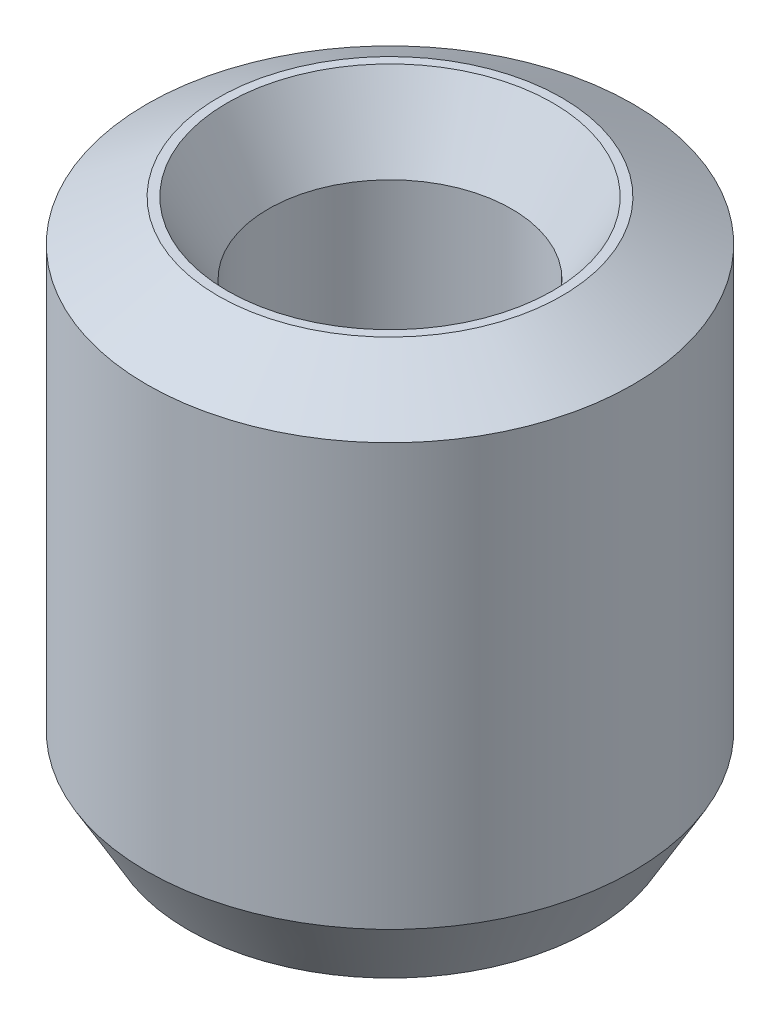
ISO-10303-21;
HEADER;
FILE_DESCRIPTION(('STEP AP214'),'2;1');
FILE_NAME('part.step','',(''),(''),'','','');
FILE_SCHEMA(('AUTOMOTIVE_DESIGN { 1 0 10303 214 1 1 1 1 }'));
ENDSEC;
DATA;
#1=APPLICATION_CONTEXT('core data for automotive mechanical design processes');
#2=APPLICATION_PROTOCOL_DEFINITION('international standard','automotive_design',2000,#1);
#3=PRODUCT_CONTEXT('',#1,'mechanical');
#4=PRODUCT('Part','Part','',(#3));
#5=PRODUCT_RELATED_PRODUCT_CATEGORY('part','',(#4));
#6=PRODUCT_DEFINITION_FORMATION('','',#4);
#7=PRODUCT_DEFINITION_CONTEXT('part definition',#1,'design');
#8=PRODUCT_DEFINITION('design','',#6,#7);
#9=PRODUCT_DEFINITION_SHAPE('','',#8);
#10=(LENGTH_UNIT() NAMED_UNIT(*) SI_UNIT(.MILLI.,.METRE.));
#11=(NAMED_UNIT(*) PLANE_ANGLE_UNIT() SI_UNIT($,.RADIAN.));
#12=(NAMED_UNIT(*) SI_UNIT($,.STERADIAN.) SOLID_ANGLE_UNIT());
#13=UNCERTAINTY_MEASURE_WITH_UNIT(LENGTH_MEASURE(1.E-05),#10,'distance_accuracy_value','');
#14=(GEOMETRIC_REPRESENTATION_CONTEXT(3) GLOBAL_UNCERTAINTY_ASSIGNED_CONTEXT((#13)) GLOBAL_UNIT_ASSIGNED_CONTEXT((#10,
#11,#12)) REPRESENTATION_CONTEXT('',''));
#15=CARTESIAN_POINT('',(0.,0.,0.));
#16=DIRECTION('',(0.,0.,1.));
#17=DIRECTION('',(1.,0.,0.));
#18=AXIS2_PLACEMENT_3D('',#15,#16,#17);
#19=CARTESIAN_POINT('',(0.,49.4186081053052,0.));
#20=DIRECTION('',(0.,-1.,0.));
#21=DIRECTION('',(0.,0.,-1.));
#22=AXIS2_PLACEMENT_3D('',#19,#20,#21);
#23=CYLINDRICAL_SURFACE('',#22,22.5);
#24=CARTESIAN_POINT('',(0.,6.59709905746745,0.));
#25=DIRECTION('',(0.,1.,0.));
#26=DIRECTION('',(0.,0.,1.));
#27=AXIS2_PLACEMENT_3D('',#24,#25,#26);
#28=CIRCLE('',#27,22.5);
#29=CARTESIAN_POINT('',(0.,6.59709905746745,22.5));
#30=VERTEX_POINT('',#29);
#31=EDGE_CURVE('E10',#30,#30,#28,.T.);
#32=ORIENTED_EDGE('',*,*,#31,.T.);
#33=EDGE_LOOP('',(#32));
#34=FACE_BOUND('',#33,.T.);
#35=CARTESIAN_POINT('',(0.,45.6097711886058,0.));
#36=DIRECTION('',(0.,1.,0.));
#37=DIRECTION('',(0.,0.,1.));
#38=AXIS2_PLACEMENT_3D('',#35,#36,#37);
#39=CIRCLE('',#38,22.5);
#40=CARTESIAN_POINT('',(0.,45.6097711886058,-22.5));
#41=VERTEX_POINT('',#40);
#42=EDGE_CURVE('E50',#41,#41,#39,.F.);
#43=ORIENTED_EDGE('',*,*,#42,.T.);
#44=EDGE_LOOP('',(#43));
#45=FACE_BOUND('',#44,.T.);
#46=ADVANCED_FACE('F39',(#34,#45),#23,.T.);
#47=CARTESIAN_POINT('',(0.,49.4186081053052,0.));
#48=DIRECTION('',(0.,1.,0.));
#49=DIRECTION('',(0.,0.,1.));
#50=AXIS2_PLACEMENT_3D('',#47,#48,#49);
#51=PLANE('',#50);
#52=CARTESIAN_POINT('',(0.,49.4186081053052,0.));
#53=DIRECTION('',(0.,1.,0.));
#54=DIRECTION('',(0.,0.,1.));
#55=AXIS2_PLACEMENT_3D('',#52,#53,#54);
#56=CIRCLE('',#55,15.0686838741817);
#57=CARTESIAN_POINT('',(0.,49.4186081053052,15.0686838741817));
#58=VERTEX_POINT('',#57);
#59=EDGE_CURVE('E58',#58,#58,#56,.F.);
#60=ORIENTED_EDGE('',*,*,#59,.T.);
#61=EDGE_LOOP('',(#60));
#62=FACE_BOUND('',#61,.T.);
#63=CARTESIAN_POINT('',(0.,49.4186081053052,0.));
#64=DIRECTION('',(0.,1.,0.));
#65=DIRECTION('',(0.,0.,1.));
#66=AXIS2_PLACEMENT_3D('',#63,#64,#65);
#67=CIRCLE('',#66,15.9029009425326);
#68=CARTESIAN_POINT('',(0.,49.4186081053052,-15.9029009425326));
#69=VERTEX_POINT('',#68);
#70=EDGE_CURVE('E61',#69,#69,#67,.T.);
#71=ORIENTED_EDGE('',*,*,#70,.T.);
#72=EDGE_LOOP('',(#71));
#73=FACE_BOUND('',#72,.T.);
#74=ADVANCED_FACE('F88',(#62,#73),#51,.T.);
#75=CARTESIAN_POINT('',(0.,0.,0.));
#76=DIRECTION('',(0.,1.,0.));
#77=DIRECTION('',(0.,0.,1.));
#78=AXIS2_PLACEMENT_3D('',#75,#76,#77);
#79=PLANE('',#78);
#80=CARTESIAN_POINT('',(0.,0.,0.));
#81=DIRECTION('',(0.,1.,0.));
#82=DIRECTION('',(0.,0.,1.));
#83=AXIS2_PLACEMENT_3D('',#80,#81,#82);
#84=CIRCLE('',#83,17.8569460149497);
#85=CARTESIAN_POINT('',(0.,0.,17.8569460149497));
#86=VERTEX_POINT('',#85);
#87=EDGE_CURVE('E51',#86,#86,#84,.T.);
#88=ORIENTED_EDGE('',*,*,#87,.T.);
#89=EDGE_LOOP('',(#88));
#90=FACE_BOUND('',#89,.T.);
#91=CARTESIAN_POINT('',(0.,0.,0.));
#92=DIRECTION('',(0.,1.,0.));
#93=DIRECTION('',(0.,0.,1.));
#94=AXIS2_PLACEMENT_3D('',#91,#92,#93);
#95=CIRCLE('',#94,18.6911630833005);
#96=CARTESIAN_POINT('',(0.,0.,18.6911630833005));
#97=VERTEX_POINT('',#96);
#98=EDGE_CURVE('E54',#97,#97,#95,.F.);
#99=ORIENTED_EDGE('',*,*,#98,.T.);
#100=EDGE_LOOP('',(#99));
#101=FACE_BOUND('',#100,.T.);
#102=ADVANCED_FACE('F83',(#90,#101),#79,.F.);
#103=CARTESIAN_POINT('',(0.,49.4186081053052,0.));
#104=DIRECTION('',(0.,-1.,0.));
#105=DIRECTION('',(0.,0.,-1.));
#106=AXIS2_PLACEMENT_3D('',#103,#104,#105);
#107=CYLINDRICAL_SURFACE('',#106,11.2598469574823);
#108=CARTESIAN_POINT('',(0.,42.8215090478378,0.));
#109=DIRECTION('',(0.,1.,0.));
#110=DIRECTION('',(0.,0.,1.));
#111=AXIS2_PLACEMENT_3D('',#108,#109,#110);
#112=CIRCLE('',#111,11.2598469574823);
#113=CARTESIAN_POINT('',(0.,42.8215090478378,11.2598469574823));
#114=VERTEX_POINT('',#113);
#115=EDGE_CURVE('E67',#114,#114,#112,.T.);
#116=ORIENTED_EDGE('',*,*,#115,.T.);
#117=EDGE_LOOP('',(#116));
#118=FACE_BOUND('',#117,.T.);
#119=CARTESIAN_POINT('',(0.,3.80883691669949,0.));
#120=DIRECTION('',(0.,1.,0.));
#121=DIRECTION('',(0.,0.,1.));
#122=AXIS2_PLACEMENT_3D('',#119,#120,#121);
#123=CIRCLE('',#122,11.2598469574823);
#124=CARTESIAN_POINT('',(0.,3.80883691669949,11.2598469574823));
#125=VERTEX_POINT('',#124);
#126=EDGE_CURVE('E69',#125,#125,#123,.F.);
#127=ORIENTED_EDGE('',*,*,#126,.T.);
#128=EDGE_LOOP('',(#127));
#129=FACE_BOUND('',#128,.T.);
#130=ADVANCED_FACE('F71',(#118,#129),#107,.F.);
#131=CARTESIAN_POINT('',(0.,42.8215090478378,0.));
#132=DIRECTION('',(0.,1.,0.));
#133=DIRECTION('',(0.,0.,1.));
#134=AXIS2_PLACEMENT_3D('',#131,#132,#133);
#135=CONICAL_SURFACE('',#134,11.2598469574823,0.523598775598302);
#136=CARTESIAN_POINT('',(0.,49.4186081053052,15.0686838741817));
#137=CARTESIAN_POINT('',(0.,49.3498883234566,15.0290084896328));
#138=CARTESIAN_POINT('',(0.,49.281168541608,14.9893331050838));
#139=CARTESIAN_POINT('',(0.,49.1437289779108,14.9099823359859));
#140=CARTESIAN_POINT('',(0.,49.0750091960621,14.870306951437));
#141=CARTESIAN_POINT('',(0.,48.9375696323649,14.7909561823391));
#142=CARTESIAN_POINT('',(0.,48.8688498505163,14.7512807977901));
#143=CARTESIAN_POINT('',(0.,48.731410286819,14.6719300286922));
#144=CARTESIAN_POINT('',(0.,48.6626905049704,14.6322546441432));
#145=CARTESIAN_POINT('',(0.,48.5252509412732,14.5529038750453));
#146=CARTESIAN_POINT('',(0.,48.4565311594246,14.5132284904964));
#147=CARTESIAN_POINT('',(0.,48.3190915957273,14.4338777213985));
#148=CARTESIAN_POINT('',(0.,48.2503718138787,14.3942023368495));
#149=CARTESIAN_POINT('',(0.,48.1129322501815,14.3148515677516));
#150=CARTESIAN_POINT('',(0.,48.0442124683329,14.2751761832027));
#151=CARTESIAN_POINT('',(0.,47.9067729046356,14.1958254141048));
#152=CARTESIAN_POINT('',(0.,47.838053122787,14.1561500295558));
#153=CARTESIAN_POINT('',(0.,47.7006135590898,14.0767992604579));
#154=CARTESIAN_POINT('',(0.,47.6318937772411,14.037123875909));
#155=CARTESIAN_POINT('',(0.,47.4944542135439,13.957773106811));
#156=CARTESIAN_POINT('',(0.,47.4257344316953,13.9180977222621));
#157=CARTESIAN_POINT('',(0.,47.288294867998,13.8387469531642));
#158=CARTESIAN_POINT('',(0.,47.2195750861494,13.7990715686152));
#159=CARTESIAN_POINT('',(0.,47.0821355224522,13.7197207995173));
#160=CARTESIAN_POINT('',(0.,47.0134157406036,13.6800454149684));
#161=CARTESIAN_POINT('',(0.,46.8759761769063,13.6006946458705));
#162=CARTESIAN_POINT('',(0.,46.8072563950577,13.5610192613215));
#163=CARTESIAN_POINT('',(0.,46.6698168313605,13.4816684922236));
#164=CARTESIAN_POINT('',(0.,46.6010970495119,13.4419931076747));
#165=CARTESIAN_POINT('',(0.,46.4636574858146,13.3626423385768));
#166=CARTESIAN_POINT('',(0.,46.394937703966,13.3229669540278));
#167=CARTESIAN_POINT('',(0.,46.2574981402688,13.2436161849299));
#168=CARTESIAN_POINT('',(0.,46.1887783584201,13.2039408003809));
#169=CARTESIAN_POINT('',(0.,46.0513387947229,13.124590031283));
#170=CARTESIAN_POINT('',(0.,45.9826190128743,13.0849146467341));
#171=CARTESIAN_POINT('',(0.,45.845179449177,13.0055638776362));
#172=CARTESIAN_POINT('',(0.,45.7764596673284,12.9658884930872));
#173=CARTESIAN_POINT('',(0.,45.6390201036312,12.8865377239893));
#174=CARTESIAN_POINT('',(0.,45.5703003217826,12.8468623394404));
#175=CARTESIAN_POINT('',(0.,45.4328607580853,12.7675115703425));
#176=CARTESIAN_POINT('',(0.,45.3641409762367,12.7278361857935));
#177=CARTESIAN_POINT('',(0.,45.2267014125395,12.6484854166956));
#178=CARTESIAN_POINT('',(0.,45.1579816306909,12.6088100321466));
#179=CARTESIAN_POINT('',(0.,45.0205420669936,12.5294592630487));
#180=CARTESIAN_POINT('',(0.,44.951822285145,12.4897838784998));
#181=CARTESIAN_POINT('',(0.,44.8143827214478,12.4104331094019));
#182=CARTESIAN_POINT('',(0.,44.7456629395991,12.3707577248529));
#183=CARTESIAN_POINT('',(0.,44.6082233759019,12.291406955755));
#184=CARTESIAN_POINT('',(0.,44.5395035940533,12.2517315712061));
#185=CARTESIAN_POINT('',(0.,44.402064030356,12.1723808021082));
#186=CARTESIAN_POINT('',(0.,44.3333442485074,12.1327054175592));
#187=CARTESIAN_POINT('',(0.,44.1959046848102,12.0533546484613));
#188=CARTESIAN_POINT('',(0.,44.1271849029616,12.0136792639124));
#189=CARTESIAN_POINT('',(0.,43.9897453392643,11.9343284948145));
#190=CARTESIAN_POINT('',(0.,43.9210255574157,11.8946531102655));
#191=CARTESIAN_POINT('',(0.,43.7835859937185,11.8153023411676));
#192=CARTESIAN_POINT('',(0.,43.7148662118698,11.7756269566186));
#193=CARTESIAN_POINT('',(0.,43.5774266481726,11.6962761875207));
#194=CARTESIAN_POINT('',(0.,43.508706866324,11.6566008029718));
#195=CARTESIAN_POINT('',(0.,43.3712673026268,11.5772500338739));
#196=CARTESIAN_POINT('',(0.,43.3025475207781,11.5375746493249));
#197=CARTESIAN_POINT('',(0.,43.1651079570809,11.458223880227));
#198=CARTESIAN_POINT('',(0.,43.0963881752323,11.4185484956781));
#199=CARTESIAN_POINT('',(0.,42.958948611535,11.3391977265802));
#200=CARTESIAN_POINT('',(0.,42.8902288296864,11.2995223420312));
#201=CARTESIAN_POINT('',(0.,42.8215090478378,11.2598469574823));
#202=B_SPLINE_CURVE_WITH_KNOTS('',3,(#136,#137,#138,#139,#140,#141,#142,#143,#144,#145,#146,
#147,#148,#149,#150,#151,#152,#153,#154,#155,#156,#157,#158,#159,#160,#161,#162,#163,#164,#165,
#166,#167,#168,#169,#170,#171,#172,#173,#174,#175,#176,#177,#178,#179,#180,#181,#182,#183,#184,
#185,#186,#187,#188,#189,#190,#191,#192,#193,#194,#195,#196,#197,#198,#199,#200,#201),
.UNSPECIFIED.,.F.,.F.,(4,2,2,2,2,2,2,2,2,2,2,2,2,2,2,2,2,2,2,2,2,2,2,2,2,2,2,2,2,2,2,2,4),(0.,
0.238052307293712,0.476104614587432,0.714156921881143,0.952209229174863,1.19026153646858,
1.42831384376229,1.66636615105601,1.90441845834972,2.14247076564344,2.38052307293716,
2.61857538023087,2.85662768752459,3.09467999481831,3.33273230211202,3.57078460940574,
3.80883691669945,4.04688922399317,4.28494153128689,4.5229938385806,4.76104614587432,
4.99909845316804,5.23715076046175,5.47520306775547,5.71325537504919,5.9513076823429,
6.18935998963662,6.42741229693033,6.66546460422405,6.90351691151777,7.14156921881148,
7.3796215261052,7.61767383339891),.UNSPECIFIED.);
#203=EDGE_CURVE('BSEAM77',#58,#114,#202,.T.);
#204=ORIENTED_EDGE('',*,*,#59,.F.);
#205=ORIENTED_EDGE('',*,*,#115,.F.);
#206=ORIENTED_EDGE('',*,*,#203,.T.);
#207=ORIENTED_EDGE('',*,*,#203,.F.);
#208=EDGE_LOOP('',(#204,#206,#205,#207));
#209=FACE_BOUND('',#208,.T.);
#210=ADVANCED_FACE('F77',(#209),#135,.F.);
#211=CARTESIAN_POINT('',(0.,0.,0.));
#212=DIRECTION('',(0.,-1.,0.));
#213=DIRECTION('',(0.,0.,-1.));
#214=AXIS2_PLACEMENT_3D('',#211,#212,#213);
#215=CONICAL_SURFACE('',#214,17.8569460149497,1.04719755119659);
#216=ORIENTED_EDGE('',*,*,#126,.F.);
#217=EDGE_LOOP('',(#216));
#218=FACE_BOUND('',#217,.T.);
#219=ORIENTED_EDGE('',*,*,#87,.F.);
#220=EDGE_LOOP('',(#219));
#221=FACE_BOUND('',#220,.T.);
#222=ADVANCED_FACE('F73',(#218,#221),#215,.F.);
#223=CARTESIAN_POINT('',(0.,6.59709905746745,0.));
#224=DIRECTION('',(0.,1.,0.));
#225=DIRECTION('',(0.,0.,1.));
#226=AXIS2_PLACEMENT_3D('',#223,#224,#225);
#227=CONICAL_SURFACE('',#226,22.5,0.523598775598303);
#228=ORIENTED_EDGE('',*,*,#98,.F.);
#229=EDGE_LOOP('',(#228));
#230=FACE_BOUND('',#229,.T.);
#231=ORIENTED_EDGE('',*,*,#31,.F.);
#232=EDGE_LOOP('',(#231));
#233=FACE_BOUND('',#232,.T.);
#234=ADVANCED_FACE('F76',(#230,#233),#227,.T.);
#235=CARTESIAN_POINT('',(0.,49.4186081053052,0.));
#236=DIRECTION('',(0.,-1.,0.));
#237=DIRECTION('',(0.,0.,-1.));
#238=AXIS2_PLACEMENT_3D('',#235,#236,#237);
#239=CONICAL_SURFACE('',#238,15.9029009425326,1.04719755119659);
#240=CARTESIAN_POINT('',(0.,45.6097711886058,-22.5));
#241=CARTESIAN_POINT('',(0.,45.6494465731547,-22.4312802181514));
#242=CARTESIAN_POINT('',(0.,45.6891219577037,-22.3625604363028));
#243=CARTESIAN_POINT('',(0.,45.7684727268016,-22.2251208726055));
#244=CARTESIAN_POINT('',(0.,45.8081481113505,-22.1564010907569));
#245=CARTESIAN_POINT('',(0.,45.8874988804484,-22.0189615270597));
#246=CARTESIAN_POINT('',(0.,45.9271742649974,-21.9502417452111));
#247=CARTESIAN_POINT('',(0.,46.0065250340953,-21.8128021815138));
#248=CARTESIAN_POINT('',(0.,46.0462004186442,-21.7440823996652));
#249=CARTESIAN_POINT('',(0.,46.1255511877421,-21.606642835968));
#250=CARTESIAN_POINT('',(0.,46.1652265722911,-21.5379230541193));
#251=CARTESIAN_POINT('',(0.,46.244577341389,-21.4004834904221));
#252=CARTESIAN_POINT('',(0.,46.284252725938,-21.3317637085735));
#253=CARTESIAN_POINT('',(0.,46.3636034950359,-21.1943241448762));
#254=CARTESIAN_POINT('',(0.,46.4032788795848,-21.1256043630276));
#255=CARTESIAN_POINT('',(0.,46.4826296486827,-20.9881647993304));
#256=CARTESIAN_POINT('',(0.,46.5223050332317,-20.9194450174818));
#257=CARTESIAN_POINT('',(0.,46.6016558023296,-20.7820054537845));
#258=CARTESIAN_POINT('',(0.,46.6413311868785,-20.7132856719359));
#259=CARTESIAN_POINT('',(0.,46.7206819559764,-20.5758461082387));
#260=CARTESIAN_POINT('',(0.,46.7603573405254,-20.5071263263901));
#261=CARTESIAN_POINT('',(0.,46.8397081096233,-20.3696867626928));
#262=CARTESIAN_POINT('',(0.,46.8793834941722,-20.3009669808442));
#263=CARTESIAN_POINT('',(0.,46.9587342632702,-20.163527417147));
#264=CARTESIAN_POINT('',(0.,46.9984096478191,-20.0948076352983));
#265=CARTESIAN_POINT('',(0.,47.077760416917,-19.9573680716011));
#266=CARTESIAN_POINT('',(0.,47.117435801466,-19.8886482897525));
#267=CARTESIAN_POINT('',(0.,47.1967865705639,-19.7512087260552));
#268=CARTESIAN_POINT('',(0.,47.2364619551128,-19.6824889442066));
#269=CARTESIAN_POINT('',(0.,47.3158127242107,-19.5450493805094));
#270=CARTESIAN_POINT('',(0.,47.3554881087597,-19.4763295986608));
#271=CARTESIAN_POINT('',(0.,47.4348388778576,-19.3388900349635));
#272=CARTESIAN_POINT('',(0.,47.4745142624065,-19.2701702531149));
#273=CARTESIAN_POINT('',(0.,47.5538650315044,-19.1327306894177));
#274=CARTESIAN_POINT('',(0.,47.5935404160534,-19.064010907569));
#275=CARTESIAN_POINT('',(0.,47.6728911851513,-18.9265713438718));
#276=CARTESIAN_POINT('',(0.,47.7125665697003,-18.8578515620232));
#277=CARTESIAN_POINT('',(0.,47.7919173387982,-18.720411998326));
#278=CARTESIAN_POINT('',(0.,47.8315927233471,-18.6516922164773));
#279=CARTESIAN_POINT('',(0.,47.910943492445,-18.5142526527801));
#280=CARTESIAN_POINT('',(0.,47.950618876994,-18.4455328709315));
#281=CARTESIAN_POINT('',(0.,48.0299696460919,-18.3080933072342));
#282=CARTESIAN_POINT('',(0.,48.0696450306408,-18.2393735253856));
#283=CARTESIAN_POINT('',(0.,48.1489957997387,-18.1019339616884));
#284=CARTESIAN_POINT('',(0.,48.1886711842877,-18.0332141798398));
#285=CARTESIAN_POINT('',(0.,48.2680219533856,-17.8957746161425));
#286=CARTESIAN_POINT('',(0.,48.3076973379346,-17.8270548342939));
#287=CARTESIAN_POINT('',(0.,48.3870481070325,-17.6896152705967));
#288=CARTESIAN_POINT('',(0.,48.4267234915814,-17.620895488748));
#289=CARTESIAN_POINT('',(0.,48.5060742606793,-17.4834559250508));
#290=CARTESIAN_POINT('',(0.,48.5457496452283,-17.4147361432022));
#291=CARTESIAN_POINT('',(0.,48.6251004143262,-17.277296579505));
#292=CARTESIAN_POINT('',(0.,48.6647757988751,-17.2085767976563));
#293=CARTESIAN_POINT('',(0.,48.744126567973,-17.0711372339591));
#294=CARTESIAN_POINT('',(0.,48.783801952522,-17.0024174521105));
#295=CARTESIAN_POINT('',(0.,48.8631527216199,-16.8649778884132));
#296=CARTESIAN_POINT('',(0.,48.9028281061688,-16.7962581065646));
#297=CARTESIAN_POINT('',(0.,48.9821788752667,-16.6588185428674));
#298=CARTESIAN_POINT('',(0.,49.0218542598157,-16.5900987610188));
#299=CARTESIAN_POINT('',(0.,49.1012050289136,-16.4526591973215));
#300=CARTESIAN_POINT('',(0.,49.1408804134626,-16.3839394154729));
#301=CARTESIAN_POINT('',(0.,49.2202311825605,-16.2464998517757));
#302=CARTESIAN_POINT('',(0.,49.2599065671094,-16.177780069927));
#303=CARTESIAN_POINT('',(0.,49.3392573362073,-16.0403405062298));
#304=CARTESIAN_POINT('',(0.,49.3789327207563,-15.9716207243812));
#305=CARTESIAN_POINT('',(0.,49.4186081053052,-15.9029009425326));
#306=B_SPLINE_CURVE_WITH_KNOTS('',3,(#240,#241,#242,#243,#244,#245,#246,#247,#248,#249,#250,
#251,#252,#253,#254,#255,#256,#257,#258,#259,#260,#261,#262,#263,#264,#265,#266,#267,#268,#269,
#270,#271,#272,#273,#274,#275,#276,#277,#278,#279,#280,#281,#282,#283,#284,#285,#286,#287,#288,
#289,#290,#291,#292,#293,#294,#295,#296,#297,#298,#299,#300,#301,#302,#303,#304,#305),
.UNSPECIFIED.,.F.,.F.,(4,2,2,2,2,2,2,2,2,2,2,2,2,2,2,2,2,2,2,2,2,2,2,2,2,2,2,2,2,2,2,2,4),(0.,
0.23805230729371,0.476104614587429,0.714156921881146,0.952209229174862,1.19026153646857,
1.42831384376229,1.66636615105601,1.90441845834973,2.14247076564344,2.38052307293716,
2.61857538023088,2.85662768752459,3.09467999481831,3.33273230211202,3.57078460940574,
3.80883691669946,4.04688922399317,4.28494153128689,4.52299383858061,4.76104614587432,
4.99909845316804,5.23715076046175,5.47520306775547,5.71325537504919,5.9513076823429,
6.18935998963662,6.42741229693034,6.66546460422405,6.90351691151777,7.14156921881148,
7.3796215261052,7.61767383339892),.UNSPECIFIED.);
#307=EDGE_CURVE('BSEAM45',#41,#69,#306,.T.);
#308=ORIENTED_EDGE('',*,*,#42,.F.);
#309=ORIENTED_EDGE('',*,*,#70,.F.);
#310=ORIENTED_EDGE('',*,*,#307,.T.);
#311=ORIENTED_EDGE('',*,*,#307,.F.);
#312=EDGE_LOOP('',(#308,#310,#309,#311));
#313=FACE_BOUND('',#312,.T.);
#314=ADVANCED_FACE('F45',(#313),#239,.T.);
#315=CLOSED_SHELL('',(#46,#74,#102,#130,#210,#222,#234,#314));
#316=MANIFOLD_SOLID_BREP('B2',#315);
#317=ADVANCED_BREP_SHAPE_REPRESENTATION('',(#18,#316),#14);
#318=SHAPE_DEFINITION_REPRESENTATION(#9,#317);
ENDSEC;
END-ISO-10303-21;
